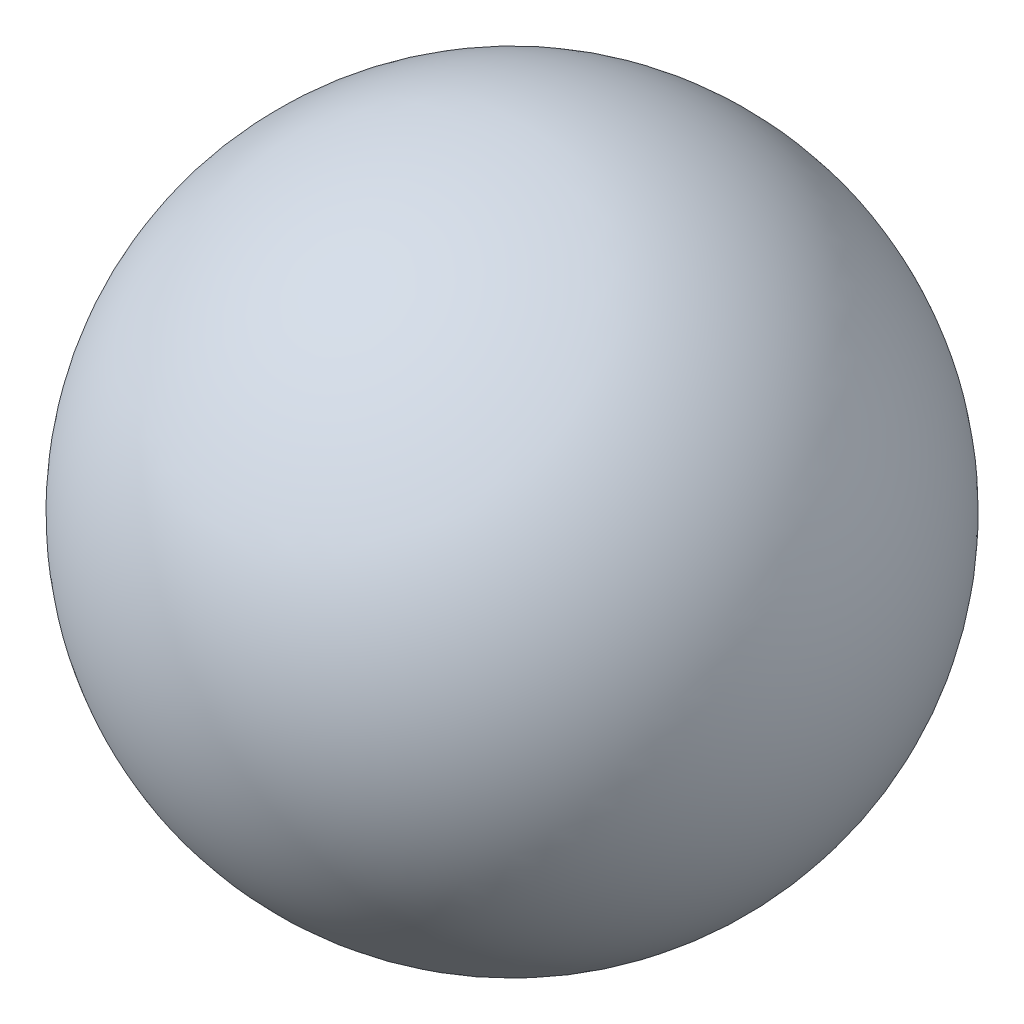
ISO-10303-21;
HEADER;
FILE_DESCRIPTION(('STEP AP214'),'2;1');
FILE_NAME('part.step','',(''),(''),'','','');
FILE_SCHEMA(('AUTOMOTIVE_DESIGN { 1 0 10303 214 1 1 1 1 }'));
ENDSEC;
DATA;
#1=APPLICATION_CONTEXT('core data for automotive mechanical design processes');
#2=APPLICATION_PROTOCOL_DEFINITION('international standard','automotive_design',2000,#1);
#3=PRODUCT_CONTEXT('',#1,'mechanical');
#4=PRODUCT('Part','Part','',(#3));
#5=PRODUCT_RELATED_PRODUCT_CATEGORY('part','',(#4));
#6=PRODUCT_DEFINITION_FORMATION('','',#4);
#7=PRODUCT_DEFINITION_CONTEXT('part definition',#1,'design');
#8=PRODUCT_DEFINITION('design','',#6,#7);
#9=PRODUCT_DEFINITION_SHAPE('','',#8);
#10=(LENGTH_UNIT() NAMED_UNIT(*) SI_UNIT(.MILLI.,.METRE.));
#11=(NAMED_UNIT(*) PLANE_ANGLE_UNIT() SI_UNIT($,.RADIAN.));
#12=(NAMED_UNIT(*) SI_UNIT($,.STERADIAN.) SOLID_ANGLE_UNIT());
#13=UNCERTAINTY_MEASURE_WITH_UNIT(LENGTH_MEASURE(1.E-05),#10,'distance_accuracy_value','');
#14=(GEOMETRIC_REPRESENTATION_CONTEXT(3) GLOBAL_UNCERTAINTY_ASSIGNED_CONTEXT((#13)) GLOBAL_UNIT_ASSIGNED_CONTEXT((#10,
#11,#12)) REPRESENTATION_CONTEXT('',''));
#15=CARTESIAN_POINT('',(0.,0.,0.));
#16=DIRECTION('',(0.,0.,1.));
#17=DIRECTION('',(1.,0.,0.));
#18=AXIS2_PLACEMENT_3D('',#15,#16,#17);
#19=CARTESIAN_POINT('',(0.,0.,-0.95));
#20=DIRECTION('',(0.,0.,1.));
#21=DIRECTION('',(-1.,0.,0.));
#22=AXIS2_PLACEMENT_3D('',#19,#20,#21);
#23=SPHERICAL_SURFACE('',#22,0.95);
#24=CARTESIAN_POINT('',(0.,0.,0.));
#25=VERTEX_POINT('',#24);
#26=VERTEX_LOOP('',#25);
#27=FACE_BOUND('',#26,.T.);
#28=ADVANCED_FACE('F35',(#27),#23,.T.);
#29=CLOSED_SHELL('',(#28));
#30=MANIFOLD_SOLID_BREP('B2',#29);
#31=ADVANCED_BREP_SHAPE_REPRESENTATION('',(#18,#30),#14);
#32=SHAPE_DEFINITION_REPRESENTATION(#9,#31);
ENDSEC;
END-ISO-10303-21;
